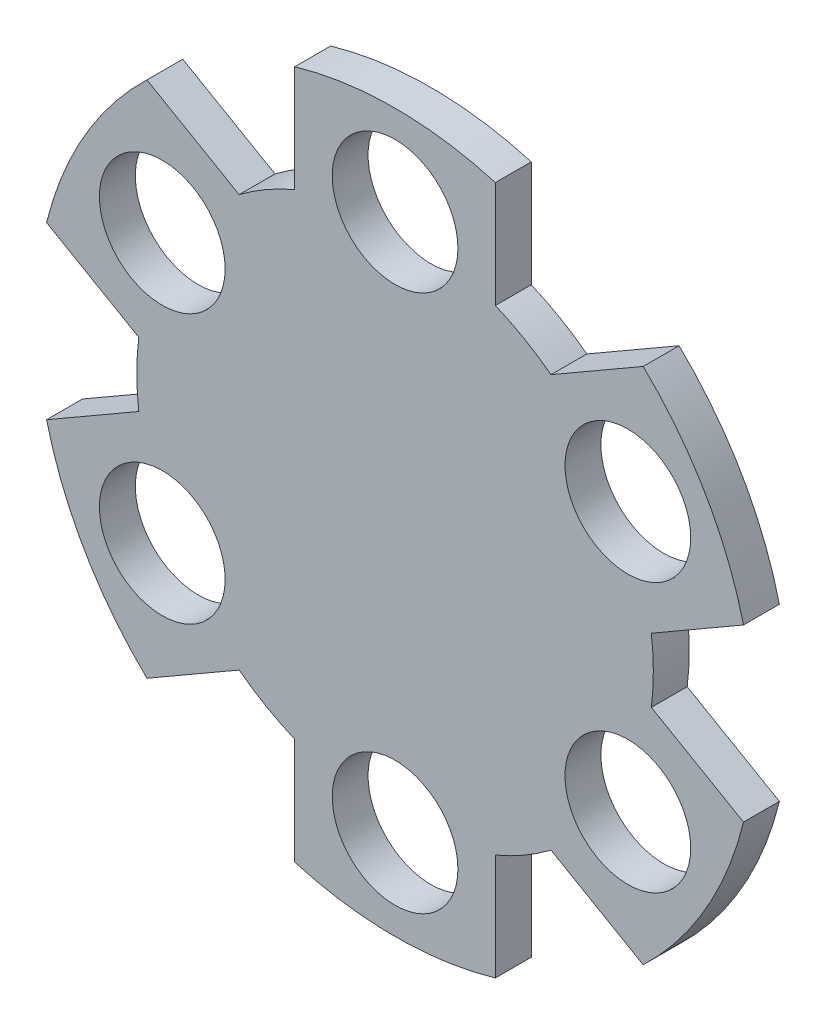
ISO-10303-21;
HEADER;
FILE_DESCRIPTION(('STEP AP214'),'2;1');
FILE_NAME('part.step','',(''),(''),'','','');
FILE_SCHEMA(('AUTOMOTIVE_DESIGN { 1 0 10303 214 1 1 1 1 }'));
ENDSEC;
DATA;
#1=APPLICATION_CONTEXT('core data for automotive mechanical design processes');
#2=APPLICATION_PROTOCOL_DEFINITION('international standard','automotive_design',2000,#1);
#3=PRODUCT_CONTEXT('',#1,'mechanical');
#4=PRODUCT('Part','Part','',(#3));
#5=PRODUCT_RELATED_PRODUCT_CATEGORY('part','',(#4));
#6=PRODUCT_DEFINITION_FORMATION('','',#4);
#7=PRODUCT_DEFINITION_CONTEXT('part definition',#1,'design');
#8=PRODUCT_DEFINITION('design','',#6,#7);
#9=PRODUCT_DEFINITION_SHAPE('','',#8);
#10=(LENGTH_UNIT() NAMED_UNIT(*) SI_UNIT(.MILLI.,.METRE.));
#11=(NAMED_UNIT(*) PLANE_ANGLE_UNIT() SI_UNIT($,.RADIAN.));
#12=(NAMED_UNIT(*) SI_UNIT($,.STERADIAN.) SOLID_ANGLE_UNIT());
#13=UNCERTAINTY_MEASURE_WITH_UNIT(LENGTH_MEASURE(1.E-05),#10,'distance_accuracy_value','');
#14=(GEOMETRIC_REPRESENTATION_CONTEXT(3) GLOBAL_UNCERTAINTY_ASSIGNED_CONTEXT((#13)) GLOBAL_UNIT_ASSIGNED_CONTEXT((#10,
#11,#12)) REPRESENTATION_CONTEXT('',''));
#15=CARTESIAN_POINT('',(0.,0.,0.));
#16=DIRECTION('',(0.,0.,1.));
#17=DIRECTION('',(1.,0.,0.));
#18=AXIS2_PLACEMENT_3D('',#15,#16,#17);
#19=CARTESIAN_POINT('',(0.,0.,3.175));
#20=DIRECTION('',(0.,0.,-1.));
#21=DIRECTION('',(-1.,0.,0.));
#22=AXIS2_PLACEMENT_3D('',#19,#20,#21);
#23=CYLINDRICAL_SURFACE('',#22,31.75);
#24=CARTESIAN_POINT('',(0.,0.,0.));
#25=DIRECTION('',(0.,0.,1.));
#26=DIRECTION('',(1.,0.,0.));
#27=AXIS2_PLACEMENT_3D('',#24,#25,#26);
#28=CIRCLE('',#27,31.75);
#29=CARTESIAN_POINT('',(30.8386744389797,7.5523942459741,0.));
#30=VERTEX_POINT('',#29);
#31=CARTESIAN_POINT('',(21.9599024959468,22.9308783601874,0.));
#32=VERTEX_POINT('',#31);
#33=EDGE_CURVE('E422',#30,#32,#28,.T.);
#34=ORIENTED_EDGE('',*,*,#33,.T.);
#35=DIRECTION('',(0.,0.,-1.));
#36=VECTOR('',#35,1.);
#37=CARTESIAN_POINT('',(21.9599024959468,22.9308783601874,3.175));
#38=LINE('',#37,#36);
#39=CARTESIAN_POINT('',(21.9599024959468,22.9308783601874,3.175));
#40=VERTEX_POINT('',#39);
#41=EDGE_CURVE('E224',#40,#32,#38,.T.);
#42=ORIENTED_EDGE('',*,*,#41,.F.);
#43=CARTESIAN_POINT('',(0.,0.,3.175));
#44=DIRECTION('',(0.,0.,1.));
#45=DIRECTION('',(1.,0.,0.));
#46=AXIS2_PLACEMENT_3D('',#43,#44,#45);
#47=CIRCLE('',#46,31.75);
#48=CARTESIAN_POINT('',(30.8386744390011,7.55239424598647,3.175));
#49=VERTEX_POINT('',#48);
#50=EDGE_CURVE('E435',#49,#40,#47,.T.);
#51=ORIENTED_EDGE('',*,*,#50,.F.);
#52=DIRECTION('',(0.,0.,-1.));
#53=VECTOR('',#52,1.);
#54=CARTESIAN_POINT('',(30.8386744390011,7.55239424598647,3.175));
#55=LINE('',#54,#53);
#56=EDGE_CURVE('E248',#49,#30,#55,.T.);
#57=ORIENTED_EDGE('',*,*,#56,.T.);
#58=EDGE_LOOP('',(#34,#42,#51,#57));
#59=FACE_BOUND('',#58,.T.);
#60=ADVANCED_FACE('F30',(#59),#23,.T.);
#61=CARTESIAN_POINT('',(21.9599024959057,-22.9308783602005,0.));
#62=VERTEX_POINT('',#61);
#63=CARTESIAN_POINT('',(30.8386744390274,-7.55239424603851,0.));
#64=VERTEX_POINT('',#63);
#65=EDGE_CURVE('E425',#62,#64,#28,.T.);
#66=ORIENTED_EDGE('',*,*,#65,.T.);
#67=DIRECTION('',(0.,0.,-1.));
#68=VECTOR('',#67,1.);
#69=CARTESIAN_POINT('',(30.8386744390274,-7.55239424603851,3.175));
#70=LINE('',#69,#68);
#71=CARTESIAN_POINT('',(30.8386744390274,-7.55239424603851,3.175));
#72=VERTEX_POINT('',#71);
#73=EDGE_CURVE('E246',#72,#64,#70,.T.);
#74=ORIENTED_EDGE('',*,*,#73,.F.);
#75=CARTESIAN_POINT('',(21.9599024959611,-22.9308783602325,3.175));
#76=VERTEX_POINT('',#75);
#77=EDGE_CURVE('E457',#76,#72,#47,.T.);
#78=ORIENTED_EDGE('',*,*,#77,.F.);
#79=DIRECTION('',(0.,0.,-1.));
#80=VECTOR('',#79,1.);
#81=CARTESIAN_POINT('',(21.9599024959611,-22.9308783602325,3.175));
#82=LINE('',#81,#80);
#83=EDGE_CURVE('E273',#76,#62,#82,.T.);
#84=ORIENTED_EDGE('',*,*,#83,.T.);
#85=EDGE_LOOP('',(#66,#74,#78,#84));
#86=FACE_BOUND('',#85,.T.);
#87=ADVANCED_FACE('F412',(#86),#23,.T.);
#88=CARTESIAN_POINT('',(-8.87877194303077,-30.4832726061958,0.));
#89=VERTEX_POINT('',#88);
#90=CARTESIAN_POINT('',(8.87877194308978,-30.4832726062678,0.));
#91=VERTEX_POINT('',#90);
#92=EDGE_CURVE('E427',#89,#91,#28,.T.);
#93=ORIENTED_EDGE('',*,*,#92,.T.);
#94=DIRECTION('',(0.,0.,-1.));
#95=VECTOR('',#94,1.);
#96=CARTESIAN_POINT('',(8.87877194308978,-30.4832726062678,3.175));
#97=LINE('',#96,#95);
#98=CARTESIAN_POINT('',(8.87877194308978,-30.4832726062678,3.175));
#99=VERTEX_POINT('',#98);
#100=EDGE_CURVE('E271',#99,#91,#97,.T.);
#101=ORIENTED_EDGE('',*,*,#100,.F.);
#102=CARTESIAN_POINT('',(-8.87877194303078,-30.4832726062609,3.175));
#103=VERTEX_POINT('',#102);
#104=EDGE_CURVE('E455',#103,#99,#47,.T.);
#105=ORIENTED_EDGE('',*,*,#104,.F.);
#106=DIRECTION('',(0.,0.,-1.));
#107=VECTOR('',#106,1.);
#108=CARTESIAN_POINT('',(-8.87877194303078,-30.4832726062609,3.175));
#109=LINE('',#108,#107);
#110=EDGE_CURVE('E299',#103,#89,#109,.T.);
#111=ORIENTED_EDGE('',*,*,#110,.T.);
#112=EDGE_LOOP('',(#93,#101,#105,#111));
#113=FACE_BOUND('',#112,.T.);
#114=ADVANCED_FACE('F417',(#113),#23,.T.);
#115=CARTESIAN_POINT('',(-30.8386744389594,-7.55239424605679,0.));
#116=VERTEX_POINT('',#115);
#117=CARTESIAN_POINT('',(-21.9599024959284,-22.9308783602711,0.));
#118=VERTEX_POINT('',#117);
#119=EDGE_CURVE('E431',#116,#118,#28,.T.);
#120=ORIENTED_EDGE('',*,*,#119,.T.);
#121=DIRECTION('',(0.,0.,-1.));
#122=VECTOR('',#121,1.);
#123=CARTESIAN_POINT('',(-21.9599024959284,-22.9308783602711,3.175));
#124=LINE('',#123,#122);
#125=CARTESIAN_POINT('',(-21.9599024959284,-22.9308783602711,3.175));
#126=VERTEX_POINT('',#125);
#127=EDGE_CURVE('E297',#126,#118,#124,.T.);
#128=ORIENTED_EDGE('',*,*,#127,.F.);
#129=CARTESIAN_POINT('',(-30.8386744389827,-7.55239424607023,3.175));
#130=VERTEX_POINT('',#129);
#131=EDGE_CURVE('E39',#130,#126,#47,.T.);
#132=ORIENTED_EDGE('',*,*,#131,.F.);
#133=DIRECTION('',(0.,0.,-1.));
#134=VECTOR('',#133,1.);
#135=CARTESIAN_POINT('',(-30.8386744389827,-7.55239424607023,3.175));
#136=LINE('',#135,#134);
#137=EDGE_CURVE('E325',#130,#116,#136,.T.);
#138=ORIENTED_EDGE('',*,*,#137,.T.);
#139=EDGE_LOOP('',(#120,#128,#132,#138));
#140=FACE_BOUND('',#139,.T.);
#141=ADVANCED_FACE('F550',(#140),#23,.T.);
#142=CARTESIAN_POINT('',(-21.9599024959534,22.9308783601549,0.));
#143=VERTEX_POINT('',#142);
#144=CARTESIAN_POINT('',(-30.838674439009,7.55239424595475,0.));
#145=VERTEX_POINT('',#144);
#146=EDGE_CURVE('E34',#143,#145,#28,.T.);
#147=ORIENTED_EDGE('',*,*,#146,.T.);
#148=DIRECTION('',(0.,0.,-1.));
#149=VECTOR('',#148,1.);
#150=CARTESIAN_POINT('',(-30.838674439009,7.55239424595475,3.175));
#151=LINE('',#150,#149);
#152=CARTESIAN_POINT('',(-30.838674439009,7.55239424595475,3.175));
#153=VERTEX_POINT('',#152);
#154=EDGE_CURVE('E323',#153,#145,#151,.T.);
#155=ORIENTED_EDGE('',*,*,#154,.F.);
#156=CARTESIAN_POINT('',(-21.9599024959428,22.9308783601487,3.175));
#157=VERTEX_POINT('',#156);
#158=EDGE_CURVE('E11',#157,#153,#47,.T.);
#159=ORIENTED_EDGE('',*,*,#158,.F.);
#160=DIRECTION('',(0.,0.,-1.));
#161=VECTOR('',#160,1.);
#162=CARTESIAN_POINT('',(-21.9599024959428,22.9308783601487,3.175));
#163=LINE('',#162,#161);
#164=EDGE_CURVE('E352',#157,#143,#163,.T.);
#165=ORIENTED_EDGE('',*,*,#164,.T.);
#166=EDGE_LOOP('',(#147,#155,#159,#165));
#167=FACE_BOUND('',#166,.T.);
#168=ADVANCED_FACE('F409',(#167),#23,.T.);
#169=CARTESIAN_POINT('',(0.,0.,3.175));
#170=DIRECTION('',(0.,0.,1.));
#171=DIRECTION('',(1.,0.,0.));
#172=AXIS2_PLACEMENT_3D('',#169,#170,#171);
#173=PLANE('',#172);
#174=DIRECTION('',(-0.866025403784438,-0.500000000000001,0.));
#175=VECTOR('',#174,1.);
#176=CARTESIAN_POINT('',(13.8006085226078,18.2201077882828,3.175));
#177=LINE('',#176,#175);
#178=CARTESIAN_POINT('',(13.8006085226078,18.2201077882828,3.175));
#179=VERTEX_POINT('',#178);
#180=EDGE_CURVE('E202',#40,#179,#177,.T.);
#181=ORIENTED_EDGE('',*,*,#180,.T.);
#182=CARTESIAN_POINT('',(1.45954906846256E-12,-4.35868577823845E-11,3.175));
#183=DIRECTION('',(0.,0.,1.));
#184=DIRECTION('',(1.,0.,0.));
#185=AXIS2_PLACEMENT_3D('',#182,#183,#184);
#186=CIRCLE('',#185,22.8567084990921);
#187=CARTESIAN_POINT('',(8.87877194304915,21.0617314623936,3.175));
#188=VERTEX_POINT('',#187);
#189=EDGE_CURVE('E197',#179,#188,#186,.T.);
#190=ORIENTED_EDGE('',*,*,#189,.T.);
#191=DIRECTION('',(0.,1.,0.));
#192=VECTOR('',#191,1.);
#193=CARTESIAN_POINT('',(8.87877194304915,30.4832726061771,3.175));
#194=LINE('',#193,#192);
#195=CARTESIAN_POINT('',(8.87877194304914,30.4832726061771,3.175));
#196=VERTEX_POINT('',#195);
#197=EDGE_CURVE('E205',#188,#196,#194,.T.);
#198=ORIENTED_EDGE('',*,*,#197,.T.);
#199=CARTESIAN_POINT('',(-8.8787719430714,30.483272606184,3.175));
#200=VERTEX_POINT('',#199);
#201=EDGE_CURVE('E40',#196,#200,#47,.T.);
#202=ORIENTED_EDGE('',*,*,#201,.T.);
#203=DIRECTION('',(0.,-1.,0.));
#204=VECTOR('',#203,1.);
#205=CARTESIAN_POINT('',(-8.87877194307139,21.0617314623749,3.175));
#206=LINE('',#205,#204);
#207=CARTESIAN_POINT('',(-8.87877194307139,21.0617314623749,3.175));
#208=VERTEX_POINT('',#207);
#209=EDGE_CURVE('E336',#200,#208,#206,.T.);
#210=ORIENTED_EDGE('',*,*,#209,.T.);
#211=CARTESIAN_POINT('',(1.69316229452944E-11,-4.01642589743796E-11,3.175));
#212=DIRECTION('',(0.,0.,1.));
#213=DIRECTION('',(1.,0.,0.));
#214=AXIS2_PLACEMENT_3D('',#211,#212,#213);
#215=CIRCLE('',#214,22.8567084990891);
#216=CARTESIAN_POINT('',(-13.8006085226259,18.220107788257,3.175));
#217=VERTEX_POINT('',#216);
#218=EDGE_CURVE('E329',#208,#217,#215,.T.);
#219=ORIENTED_EDGE('',*,*,#218,.T.);
#220=DIRECTION('',(-0.866025403784439,0.5,0.));
#221=VECTOR('',#220,1.);
#222=CARTESIAN_POINT('',(-13.8006085226259,18.220107788257,3.175));
#223=LINE('',#222,#221);
#224=EDGE_CURVE('E332',#217,#157,#223,.T.);
#225=ORIENTED_EDGE('',*,*,#224,.T.);
#226=ORIENTED_EDGE('',*,*,#158,.T.);
#227=DIRECTION('',(0.866025403784439,-0.499999999999999,0.));
#228=VECTOR('',#227,1.);
#229=CARTESIAN_POINT('',(-22.67938046567,2.84162367405021,3.175));
#230=LINE('',#229,#228);
#231=CARTESIAN_POINT('',(-22.67938046567,2.84162367405021,3.175));
#232=VERTEX_POINT('',#231);
#233=EDGE_CURVE('E310',#153,#232,#230,.T.);
#234=ORIENTED_EDGE('',*,*,#233,.T.);
#235=CARTESIAN_POINT('',(1.15815757187391E-11,-3.43203041630979E-11,3.175));
#236=DIRECTION('',(0.,0.,1.));
#237=DIRECTION('',(1.,0.,0.));
#238=AXIS2_PLACEMENT_3D('',#235,#236,#237);
#239=CIRCLE('',#238,22.8567084990891);
#240=CARTESIAN_POINT('',(-22.6793804656659,-2.84162367417849,3.175));
#241=VERTEX_POINT('',#240);
#242=EDGE_CURVE('E303',#232,#241,#239,.T.);
#243=ORIENTED_EDGE('',*,*,#242,.T.);
#244=DIRECTION('',(-0.866025403784439,-0.5,0.));
#245=VECTOR('',#244,1.);
#246=CARTESIAN_POINT('',(-22.6793804656659,-2.84162367417849,3.175));
#247=LINE('',#246,#245);
#248=EDGE_CURVE('E306',#241,#130,#247,.T.);
#249=ORIENTED_EDGE('',*,*,#248,.T.);
#250=ORIENTED_EDGE('',*,*,#131,.T.);
#251=DIRECTION('',(0.866025403784438,0.500000000000001,0.));
#252=VECTOR('',#251,1.);
#253=CARTESIAN_POINT('',(-13.8006085225894,-18.2201077883666,3.175));
#254=LINE('',#253,#252);
#255=CARTESIAN_POINT('',(-13.8006085225894,-18.2201077883666,3.175));
#256=VERTEX_POINT('',#255);
#257=EDGE_CURVE('E284',#126,#256,#254,.T.);
#258=ORIENTED_EDGE('',*,*,#257,.T.);
#259=CARTESIAN_POINT('',(3.84553878032322E-12,-3.60316035671003E-11,3.175));
#260=DIRECTION('',(0.,0.,1.));
#261=DIRECTION('',(1.,0.,0.));
#262=AXIS2_PLACEMENT_3D('',#259,#260,#261);
#263=CIRCLE('',#262,22.8567084990891);
#264=CARTESIAN_POINT('',(-8.87877194303077,-21.0617314624774,3.175));
#265=VERTEX_POINT('',#264);
#266=EDGE_CURVE('E277',#256,#265,#263,.T.);
#267=ORIENTED_EDGE('',*,*,#266,.T.);
#268=DIRECTION('',(0.,-1.,0.));
#269=VECTOR('',#268,1.);
#270=CARTESIAN_POINT('',(-8.87877194303077,-21.0617314624774,3.175));
#271=LINE('',#270,#269);
#272=EDGE_CURVE('E280',#265,#103,#271,.T.);
#273=ORIENTED_EDGE('',*,*,#272,.T.);
#274=ORIENTED_EDGE('',*,*,#104,.T.);
#275=DIRECTION('',(0.,1.,0.));
#276=VECTOR('',#275,1.);
#277=CARTESIAN_POINT('',(8.87877194308978,-21.0617314624587,3.175));
#278=LINE('',#277,#276);
#279=CARTESIAN_POINT('',(8.87877194308978,-21.0617314624587,3.175));
#280=VERTEX_POINT('',#279);
#281=EDGE_CURVE('E258',#99,#280,#278,.T.);
#282=ORIENTED_EDGE('',*,*,#281,.T.);
#283=CARTESIAN_POINT('',(1.45954906846256E-12,-4.35868577823845E-11,3.175));
#284=DIRECTION('',(0.,0.,1.));
#285=DIRECTION('',(1.,0.,0.));
#286=AXIS2_PLACEMENT_3D('',#283,#284,#285);
#287=CIRCLE('',#286,22.8567084990891);
#288=CARTESIAN_POINT('',(13.8006085226443,-18.2201077883407,3.175));
#289=VERTEX_POINT('',#288);
#290=EDGE_CURVE('E251',#280,#289,#287,.T.);
#291=ORIENTED_EDGE('',*,*,#290,.T.);
#292=DIRECTION('',(0.866025403784438,-0.5,0.));
#293=VECTOR('',#292,1.);
#294=CARTESIAN_POINT('',(13.8006085226443,-18.2201077883407,3.175));
#295=LINE('',#294,#293);
#296=EDGE_CURVE('E254',#289,#76,#295,.T.);
#297=ORIENTED_EDGE('',*,*,#296,.T.);
#298=ORIENTED_EDGE('',*,*,#77,.T.);
#299=DIRECTION('',(-0.866025403784439,0.5,0.));
#300=VECTOR('',#299,1.);
#301=CARTESIAN_POINT('',(22.6793804656884,-2.84162367413396,3.175));
#302=LINE('',#301,#300);
#303=CARTESIAN_POINT('',(22.6793804656884,-2.84162367413396,3.175));
#304=VERTEX_POINT('',#303);
#305=EDGE_CURVE('E234',#72,#304,#302,.T.);
#306=ORIENTED_EDGE('',*,*,#305,.T.);
#307=CARTESIAN_POINT('',(6.80959629501781E-12,-4.94308125936663E-11,3.175));
#308=DIRECTION('',(0.,0.,1.));
#309=DIRECTION('',(1.,0.,0.));
#310=AXIS2_PLACEMENT_3D('',#307,#308,#309);
#311=CIRCLE('',#310,22.8567084990891);
#312=CARTESIAN_POINT('',(22.6793804656843,2.84162367409473,3.175));
#313=VERTEX_POINT('',#312);
#314=EDGE_CURVE('E227',#304,#313,#311,.T.);
#315=ORIENTED_EDGE('',*,*,#314,.T.);
#316=DIRECTION('',(0.866025403784439,0.5,0.));
#317=VECTOR('',#316,1.);
#318=CARTESIAN_POINT('',(22.6793804656843,2.84162367409473,3.175));
#319=LINE('',#318,#317);
#320=EDGE_CURVE('E230',#313,#49,#319,.T.);
#321=ORIENTED_EDGE('',*,*,#320,.T.);
#322=ORIENTED_EDGE('',*,*,#50,.T.);
#323=EDGE_LOOP('',(#181,#190,#198,#202,#210,#219,#225,#226,#234,#243,#249,#250,#258,#267,#273,
#274,#282,#291,#297,#298,#306,#315,#321,#322));
#324=FACE_BOUND('',#323,.T.);
#325=CARTESIAN_POINT('',(-20.6025178388072,-11.8948692202191,3.175));
#326=DIRECTION('',(0.,0.,1.));
#327=DIRECTION('',(1.,0.,0.));
#328=AXIS2_PLACEMENT_3D('',#325,#326,#327);
#329=CIRCLE('',#328,5.5626);
#330=CARTESIAN_POINT('',(-15.0399178388072,-11.8948692202191,3.175));
#331=VERTEX_POINT('',#330);
#332=EDGE_CURVE('E362',#331,#331,#329,.T.);
#333=ORIENTED_EDGE('',*,*,#332,.F.);
#334=EDGE_LOOP('',(#333));
#335=FACE_BOUND('',#334,.T.);
#336=CARTESIAN_POINT('',(20.602517838807,-11.8948692202194,3.175));
#337=DIRECTION('',(0.,0.,1.));
#338=DIRECTION('',(1.,0.,0.));
#339=AXIS2_PLACEMENT_3D('',#336,#337,#338);
#340=CIRCLE('',#339,5.5626);
#341=CARTESIAN_POINT('',(26.165117838807,-11.8948692202194,3.175));
#342=VERTEX_POINT('',#341);
#343=EDGE_CURVE('E374',#342,#342,#340,.T.);
#344=ORIENTED_EDGE('',*,*,#343,.F.);
#345=EDGE_LOOP('',(#344));
#346=FACE_BOUND('',#345,.T.);
#347=CARTESIAN_POINT('',(0.,23.7897384404387,3.175));
#348=DIRECTION('',(0.,0.,1.));
#349=DIRECTION('',(1.,0.,0.));
#350=AXIS2_PLACEMENT_3D('',#347,#348,#349);
#351=CIRCLE('',#350,5.5626);
#352=CARTESIAN_POINT('',(5.5626,23.7897384404387,3.175));
#353=VERTEX_POINT('',#352);
#354=EDGE_CURVE('E386',#353,#353,#351,.T.);
#355=ORIENTED_EDGE('',*,*,#354,.F.);
#356=EDGE_LOOP('',(#355));
#357=FACE_BOUND('',#356,.T.);
#358=CARTESIAN_POINT('',(20.6025178388071,11.8948692202193,3.175));
#359=DIRECTION('',(0.,0.,1.));
#360=DIRECTION('',(1.,0.,0.));
#361=AXIS2_PLACEMENT_3D('',#358,#359,#360);
#362=CIRCLE('',#361,5.5626);
#363=CARTESIAN_POINT('',(26.1651178388071,11.8948692202193,3.175));
#364=VERTEX_POINT('',#363);
#365=EDGE_CURVE('E380',#364,#364,#362,.T.);
#366=ORIENTED_EDGE('',*,*,#365,.F.);
#367=EDGE_LOOP('',(#366));
#368=FACE_BOUND('',#367,.T.);
#369=CARTESIAN_POINT('',(-1.66122951859872E-13,-23.7897384404387,3.175));
#370=DIRECTION('',(0.,0.,1.));
#371=DIRECTION('',(1.,0.,0.));
#372=AXIS2_PLACEMENT_3D('',#369,#370,#371);
#373=CIRCLE('',#372,5.5626);
#374=CARTESIAN_POINT('',(5.56259999999983,-23.7897384404387,3.175));
#375=VERTEX_POINT('',#374);
#376=EDGE_CURVE('E368',#375,#375,#373,.T.);
#377=ORIENTED_EDGE('',*,*,#376,.F.);
#378=EDGE_LOOP('',(#377));
#379=FACE_BOUND('',#378,.T.);
#380=CARTESIAN_POINT('',(-20.6025178388069,11.8948692202196,3.175));
#381=DIRECTION('',(0.,0.,1.));
#382=DIRECTION('',(1.,0.,0.));
#383=AXIS2_PLACEMENT_3D('',#380,#381,#382);
#384=CIRCLE('',#383,5.5626);
#385=CARTESIAN_POINT('',(-15.0399178388069,11.8948692202196,3.175));
#386=VERTEX_POINT('',#385);
#387=EDGE_CURVE('E356',#386,#386,#384,.T.);
#388=ORIENTED_EDGE('',*,*,#387,.F.);
#389=EDGE_LOOP('',(#388));
#390=FACE_BOUND('',#389,.T.);
#391=ADVANCED_FACE('F210',(#324,#335,#346,#357,#368,#379,#390),#173,.T.);
#392=CARTESIAN_POINT('',(0.,0.,0.));
#393=DIRECTION('',(0.,0.,1.));
#394=DIRECTION('',(1.,0.,0.));
#395=AXIS2_PLACEMENT_3D('',#392,#393,#394);
#396=PLANE('',#395);
#397=CARTESIAN_POINT('',(-20.6025178388072,-11.8948692202191,0.));
#398=DIRECTION('',(0.,0.,1.));
#399=DIRECTION('',(1.,0.,0.));
#400=AXIS2_PLACEMENT_3D('',#397,#398,#399);
#401=CIRCLE('',#400,5.5626);
#402=CARTESIAN_POINT('',(-15.0399178388072,-11.8948692202191,0.));
#403=VERTEX_POINT('',#402);
#404=EDGE_CURVE('E359',#403,#403,#401,.T.);
#405=ORIENTED_EDGE('',*,*,#404,.T.);
#406=EDGE_LOOP('',(#405));
#407=FACE_BOUND('',#406,.T.);
#408=CARTESIAN_POINT('',(20.602517838807,-11.8948692202194,0.));
#409=DIRECTION('',(0.,0.,1.));
#410=DIRECTION('',(1.,0.,0.));
#411=AXIS2_PLACEMENT_3D('',#408,#409,#410);
#412=CIRCLE('',#411,5.5626);
#413=CARTESIAN_POINT('',(26.165117838807,-11.8948692202194,0.));
#414=VERTEX_POINT('',#413);
#415=EDGE_CURVE('E371',#414,#414,#412,.T.);
#416=ORIENTED_EDGE('',*,*,#415,.T.);
#417=EDGE_LOOP('',(#416));
#418=FACE_BOUND('',#417,.T.);
#419=CARTESIAN_POINT('',(0.,23.7897384404387,0.));
#420=DIRECTION('',(0.,0.,1.));
#421=DIRECTION('',(1.,0.,0.));
#422=AXIS2_PLACEMENT_3D('',#419,#420,#421);
#423=CIRCLE('',#422,5.5626);
#424=CARTESIAN_POINT('',(5.5626,23.7897384404387,0.));
#425=VERTEX_POINT('',#424);
#426=EDGE_CURVE('E383',#425,#425,#423,.T.);
#427=ORIENTED_EDGE('',*,*,#426,.T.);
#428=EDGE_LOOP('',(#427));
#429=FACE_BOUND('',#428,.T.);
#430=CARTESIAN_POINT('',(1.45954906846256E-12,-4.35868577823845E-11,0.));
#431=DIRECTION('',(0.,0.,1.));
#432=DIRECTION('',(1.,0.,0.));
#433=AXIS2_PLACEMENT_3D('',#430,#431,#432);
#434=CIRCLE('',#433,22.8567084990921);
#435=CARTESIAN_POINT('',(13.8006085226078,18.2201077882828,0.));
#436=VERTEX_POINT('',#435);
#437=CARTESIAN_POINT('',(8.87877194304915,21.0617314623936,0.));
#438=VERTEX_POINT('',#437);
#439=EDGE_CURVE('E200',#436,#438,#434,.T.);
#440=ORIENTED_EDGE('',*,*,#439,.F.);
#441=DIRECTION('',(-0.866025403784438,-0.500000000000001,0.));
#442=VECTOR('',#441,1.);
#443=CARTESIAN_POINT('',(13.8006085226078,18.2201077882828,0.));
#444=LINE('',#443,#442);
#445=EDGE_CURVE('E213',#32,#436,#444,.T.);
#446=ORIENTED_EDGE('',*,*,#445,.F.);
#447=ORIENTED_EDGE('',*,*,#33,.F.);
#448=DIRECTION('',(0.866025403784439,0.5,0.));
#449=VECTOR('',#448,1.);
#450=CARTESIAN_POINT('',(22.6793804656843,2.84162367409473,0.));
#451=LINE('',#450,#449);
#452=CARTESIAN_POINT('',(22.6793804656843,2.84162367409473,0.));
#453=VERTEX_POINT('',#452);
#454=EDGE_CURVE('E55',#453,#30,#451,.T.);
#455=ORIENTED_EDGE('',*,*,#454,.F.);
#456=CARTESIAN_POINT('',(6.80959629501781E-12,-4.94308125936663E-11,0.));
#457=DIRECTION('',(0.,0.,1.));
#458=DIRECTION('',(1.,0.,0.));
#459=AXIS2_PLACEMENT_3D('',#456,#457,#458);
#460=CIRCLE('',#459,22.8567084990891);
#461=CARTESIAN_POINT('',(22.6793804656884,-2.84162367413396,0.));
#462=VERTEX_POINT('',#461);
#463=EDGE_CURVE('E223',#462,#453,#460,.T.);
#464=ORIENTED_EDGE('',*,*,#463,.F.);
#465=DIRECTION('',(-0.866025403784439,0.5,0.));
#466=VECTOR('',#465,1.);
#467=CARTESIAN_POINT('',(22.6793804656884,-2.84162367413396,0.));
#468=LINE('',#467,#466);
#469=EDGE_CURVE('E231',#64,#462,#468,.T.);
#470=ORIENTED_EDGE('',*,*,#469,.F.);
#471=ORIENTED_EDGE('',*,*,#65,.F.);
#472=DIRECTION('',(0.866025403784438,-0.5,0.));
#473=VECTOR('',#472,1.);
#474=CARTESIAN_POINT('',(13.8006085226443,-18.2201077883407,0.));
#475=LINE('',#474,#473);
#476=CARTESIAN_POINT('',(13.8006085226443,-18.2201077883407,0.));
#477=VERTEX_POINT('',#476);
#478=EDGE_CURVE('E264',#477,#62,#475,.T.);
#479=ORIENTED_EDGE('',*,*,#478,.F.);
#480=CARTESIAN_POINT('',(1.45954906846256E-12,-4.35868577823845E-11,0.));
#481=DIRECTION('',(0.,0.,1.));
#482=DIRECTION('',(1.,0.,0.));
#483=AXIS2_PLACEMENT_3D('',#480,#481,#482);
#484=CIRCLE('',#483,22.8567084990891);
#485=CARTESIAN_POINT('',(8.87877194308978,-21.0617314624587,0.));
#486=VERTEX_POINT('',#485);
#487=EDGE_CURVE('E245',#486,#477,#484,.T.);
#488=ORIENTED_EDGE('',*,*,#487,.F.);
#489=DIRECTION('',(0.,1.,0.));
#490=VECTOR('',#489,1.);
#491=CARTESIAN_POINT('',(8.87877194308978,-21.0617314624587,0.));
#492=LINE('',#491,#490);
#493=EDGE_CURVE('E255',#91,#486,#492,.T.);
#494=ORIENTED_EDGE('',*,*,#493,.F.);
#495=ORIENTED_EDGE('',*,*,#92,.F.);
#496=DIRECTION('',(0.,-1.,0.));
#497=VECTOR('',#496,1.);
#498=CARTESIAN_POINT('',(-8.87877194303077,-21.0617314624774,0.));
#499=LINE('',#498,#497);
#500=CARTESIAN_POINT('',(-8.87877194303077,-21.0617314624774,0.));
#501=VERTEX_POINT('',#500);
#502=EDGE_CURVE('E290',#501,#89,#499,.T.);
#503=ORIENTED_EDGE('',*,*,#502,.F.);
#504=CARTESIAN_POINT('',(3.84553878032322E-12,-3.60316035671003E-11,0.));
#505=DIRECTION('',(0.,0.,1.));
#506=DIRECTION('',(1.,0.,0.));
#507=AXIS2_PLACEMENT_3D('',#504,#505,#506);
#508=CIRCLE('',#507,22.8567084990891);
#509=CARTESIAN_POINT('',(-13.8006085225894,-18.2201077883666,0.));
#510=VERTEX_POINT('',#509);
#511=EDGE_CURVE('E270',#510,#501,#508,.T.);
#512=ORIENTED_EDGE('',*,*,#511,.F.);
#513=DIRECTION('',(0.866025403784438,0.500000000000001,0.));
#514=VECTOR('',#513,1.);
#515=CARTESIAN_POINT('',(-13.8006085225894,-18.2201077883666,0.));
#516=LINE('',#515,#514);
#517=EDGE_CURVE('E281',#118,#510,#516,.T.);
#518=ORIENTED_EDGE('',*,*,#517,.F.);
#519=ORIENTED_EDGE('',*,*,#119,.F.);
#520=DIRECTION('',(-0.866025403784439,-0.5,0.));
#521=VECTOR('',#520,1.);
#522=CARTESIAN_POINT('',(-22.6793804656659,-2.84162367417849,0.));
#523=LINE('',#522,#521);
#524=CARTESIAN_POINT('',(-22.6793804656659,-2.84162367417849,0.));
#525=VERTEX_POINT('',#524);
#526=EDGE_CURVE('E316',#525,#116,#523,.T.);
#527=ORIENTED_EDGE('',*,*,#526,.F.);
#528=CARTESIAN_POINT('',(1.15815757187391E-11,-3.43203041630979E-11,0.));
#529=DIRECTION('',(0.,0.,1.));
#530=DIRECTION('',(1.,0.,0.));
#531=AXIS2_PLACEMENT_3D('',#528,#529,#530);
#532=CIRCLE('',#531,22.8567084990891);
#533=CARTESIAN_POINT('',(-22.67938046567,2.84162367405021,0.));
#534=VERTEX_POINT('',#533);
#535=EDGE_CURVE('E296',#534,#525,#532,.T.);
#536=ORIENTED_EDGE('',*,*,#535,.F.);
#537=DIRECTION('',(0.866025403784439,-0.499999999999999,0.));
#538=VECTOR('',#537,1.);
#539=CARTESIAN_POINT('',(-22.67938046567,2.84162367405021,0.));
#540=LINE('',#539,#538);
#541=EDGE_CURVE('E307',#145,#534,#540,.T.);
#542=ORIENTED_EDGE('',*,*,#541,.F.);
#543=ORIENTED_EDGE('',*,*,#146,.F.);
#544=DIRECTION('',(-0.866025403784439,0.5,0.));
#545=VECTOR('',#544,1.);
#546=CARTESIAN_POINT('',(-13.8006085226259,18.220107788257,0.));
#547=LINE('',#546,#545);
#548=CARTESIAN_POINT('',(-13.8006085226259,18.220107788257,0.));
#549=VERTEX_POINT('',#548);
#550=EDGE_CURVE('E342',#549,#143,#547,.T.);
#551=ORIENTED_EDGE('',*,*,#550,.F.);
#552=CARTESIAN_POINT('',(1.69316229452944E-11,-4.01642589743796E-11,0.));
#553=DIRECTION('',(0.,0.,1.));
#554=DIRECTION('',(1.,0.,0.));
#555=AXIS2_PLACEMENT_3D('',#552,#553,#554);
#556=CIRCLE('',#555,22.8567084990891);
#557=CARTESIAN_POINT('',(-8.87877194307139,21.0617314623749,0.));
#558=VERTEX_POINT('',#557);
#559=EDGE_CURVE('E322',#558,#549,#556,.T.);
#560=ORIENTED_EDGE('',*,*,#559,.F.);
#561=DIRECTION('',(0.,-1.,0.));
#562=VECTOR('',#561,1.);
#563=CARTESIAN_POINT('',(-8.87877194307139,21.0617314623749,0.));
#564=LINE('',#563,#562);
#565=CARTESIAN_POINT('',(-8.8787719430714,30.483272606184,0.));
#566=VERTEX_POINT('',#565);
#567=EDGE_CURVE('E333',#566,#558,#564,.T.);
#568=ORIENTED_EDGE('',*,*,#567,.F.);
#569=CARTESIAN_POINT('',(8.87877194304915,30.4832726061905,0.));
#570=VERTEX_POINT('',#569);
#571=EDGE_CURVE('E389',#570,#566,#28,.T.);
#572=ORIENTED_EDGE('',*,*,#571,.F.);
#573=DIRECTION('',(0.,1.,0.));
#574=VECTOR('',#573,1.);
#575=CARTESIAN_POINT('',(8.87877194304915,30.4832726061771,0.));
#576=LINE('',#575,#574);
#577=EDGE_CURVE('E47',#438,#570,#576,.T.);
#578=ORIENTED_EDGE('',*,*,#577,.F.);
#579=EDGE_LOOP('',(#440,#446,#447,#455,#464,#470,#471,#479,#488,#494,#495,#503,#512,#518,#519,
#527,#536,#542,#543,#551,#560,#568,#572,#578));
#580=FACE_BOUND('',#579,.T.);
#581=CARTESIAN_POINT('',(20.6025178388071,11.8948692202193,0.));
#582=DIRECTION('',(0.,0.,1.));
#583=DIRECTION('',(1.,0.,0.));
#584=AXIS2_PLACEMENT_3D('',#581,#582,#583);
#585=CIRCLE('',#584,5.5626);
#586=CARTESIAN_POINT('',(26.1651178388071,11.8948692202193,0.));
#587=VERTEX_POINT('',#586);
#588=EDGE_CURVE('E377',#587,#587,#585,.T.);
#589=ORIENTED_EDGE('',*,*,#588,.T.);
#590=EDGE_LOOP('',(#589));
#591=FACE_BOUND('',#590,.T.);
#592=CARTESIAN_POINT('',(-1.66122951859872E-13,-23.7897384404387,0.));
#593=DIRECTION('',(0.,0.,1.));
#594=DIRECTION('',(1.,0.,0.));
#595=AXIS2_PLACEMENT_3D('',#592,#593,#594);
#596=CIRCLE('',#595,5.5626);
#597=CARTESIAN_POINT('',(5.56259999999983,-23.7897384404387,0.));
#598=VERTEX_POINT('',#597);
#599=EDGE_CURVE('E365',#598,#598,#596,.T.);
#600=ORIENTED_EDGE('',*,*,#599,.T.);
#601=EDGE_LOOP('',(#600));
#602=FACE_BOUND('',#601,.T.);
#603=CARTESIAN_POINT('',(-20.6025178388069,11.8948692202196,0.));
#604=DIRECTION('',(0.,0.,1.));
#605=DIRECTION('',(1.,0.,0.));
#606=AXIS2_PLACEMENT_3D('',#603,#604,#605);
#607=CIRCLE('',#606,5.5626);
#608=CARTESIAN_POINT('',(-15.0399178388069,11.8948692202196,0.));
#609=VERTEX_POINT('',#608);
#610=EDGE_CURVE('E348',#609,#609,#607,.T.);
#611=ORIENTED_EDGE('',*,*,#610,.T.);
#612=EDGE_LOOP('',(#611));
#613=FACE_BOUND('',#612,.T.);
#614=ADVANCED_FACE('F393',(#407,#418,#429,#580,#591,#602,#613),#396,.F.);
#615=ORIENTED_EDGE('',*,*,#201,.F.);
#616=DIRECTION('',(0.,0.,-1.));
#617=VECTOR('',#616,1.);
#618=CARTESIAN_POINT('',(8.87877194304914,30.4832726061771,3.175));
#619=LINE('',#618,#617);
#620=EDGE_CURVE('E201',#196,#570,#619,.T.);
#621=ORIENTED_EDGE('',*,*,#620,.T.);
#622=ORIENTED_EDGE('',*,*,#571,.T.);
#623=DIRECTION('',(0.,0.,-1.));
#624=VECTOR('',#623,1.);
#625=CARTESIAN_POINT('',(-8.8787719430714,30.483272606184,3.175));
#626=LINE('',#625,#624);
#627=EDGE_CURVE('E349',#200,#566,#626,.T.);
#628=ORIENTED_EDGE('',*,*,#627,.F.);
#629=EDGE_LOOP('',(#615,#621,#622,#628));
#630=FACE_BOUND('',#629,.T.);
#631=ADVANCED_FACE('F32',(#630),#23,.T.);
#632=CARTESIAN_POINT('',(0.,23.7897384404387,3.175));
#633=DIRECTION('',(0.,0.,-1.));
#634=DIRECTION('',(-1.,0.,0.));
#635=AXIS2_PLACEMENT_3D('',#632,#633,#634);
#636=CYLINDRICAL_SURFACE('',#635,5.5626);
#637=ORIENTED_EDGE('',*,*,#354,.T.);
#638=EDGE_LOOP('',(#637));
#639=FACE_BOUND('',#638,.T.);
#640=ORIENTED_EDGE('',*,*,#426,.F.);
#641=EDGE_LOOP('',(#640));
#642=FACE_BOUND('',#641,.T.);
#643=ADVANCED_FACE('F396',(#639,#642),#636,.F.);
#644=CARTESIAN_POINT('',(20.6025178388071,11.8948692202193,3.175));
#645=DIRECTION('',(0.,0.,-1.));
#646=DIRECTION('',(-1.,0.,0.));
#647=AXIS2_PLACEMENT_3D('',#644,#645,#646);
#648=CYLINDRICAL_SURFACE('',#647,5.5626);
#649=ORIENTED_EDGE('',*,*,#365,.T.);
#650=EDGE_LOOP('',(#649));
#651=FACE_BOUND('',#650,.T.);
#652=ORIENTED_EDGE('',*,*,#588,.F.);
#653=EDGE_LOOP('',(#652));
#654=FACE_BOUND('',#653,.T.);
#655=ADVANCED_FACE('F398',(#651,#654),#648,.F.);
#656=CARTESIAN_POINT('',(20.602517838807,-11.8948692202194,3.175));
#657=DIRECTION('',(0.,0.,-1.));
#658=DIRECTION('',(-1.,0.,0.));
#659=AXIS2_PLACEMENT_3D('',#656,#657,#658);
#660=CYLINDRICAL_SURFACE('',#659,5.5626);
#661=ORIENTED_EDGE('',*,*,#343,.T.);
#662=EDGE_LOOP('',(#661));
#663=FACE_BOUND('',#662,.T.);
#664=ORIENTED_EDGE('',*,*,#415,.F.);
#665=EDGE_LOOP('',(#664));
#666=FACE_BOUND('',#665,.T.);
#667=ADVANCED_FACE('F405',(#663,#666),#660,.F.);
#668=CARTESIAN_POINT('',(-1.66122951859872E-13,-23.7897384404387,3.175));
#669=DIRECTION('',(0.,0.,-1.));
#670=DIRECTION('',(-1.,0.,0.));
#671=AXIS2_PLACEMENT_3D('',#668,#669,#670);
#672=CYLINDRICAL_SURFACE('',#671,5.5626);
#673=ORIENTED_EDGE('',*,*,#376,.T.);
#674=EDGE_LOOP('',(#673));
#675=FACE_BOUND('',#674,.T.);
#676=ORIENTED_EDGE('',*,*,#599,.F.);
#677=EDGE_LOOP('',(#676));
#678=FACE_BOUND('',#677,.T.);
#679=ADVANCED_FACE('F527',(#675,#678),#672,.F.);
#680=CARTESIAN_POINT('',(-20.6025178388072,-11.8948692202191,3.175));
#681=DIRECTION('',(0.,0.,-1.));
#682=DIRECTION('',(-1.,0.,0.));
#683=AXIS2_PLACEMENT_3D('',#680,#681,#682);
#684=CYLINDRICAL_SURFACE('',#683,5.5626);
#685=ORIENTED_EDGE('',*,*,#332,.T.);
#686=EDGE_LOOP('',(#685));
#687=FACE_BOUND('',#686,.T.);
#688=ORIENTED_EDGE('',*,*,#404,.F.);
#689=EDGE_LOOP('',(#688));
#690=FACE_BOUND('',#689,.T.);
#691=ADVANCED_FACE('F523',(#687,#690),#684,.F.);
#692=CARTESIAN_POINT('',(-20.6025178388069,11.8948692202196,3.175));
#693=DIRECTION('',(0.,0.,-1.));
#694=DIRECTION('',(-1.,0.,0.));
#695=AXIS2_PLACEMENT_3D('',#692,#693,#694);
#696=CYLINDRICAL_SURFACE('',#695,5.5626);
#697=ORIENTED_EDGE('',*,*,#387,.T.);
#698=EDGE_LOOP('',(#697));
#699=FACE_BOUND('',#698,.T.);
#700=ORIENTED_EDGE('',*,*,#610,.F.);
#701=EDGE_LOOP('',(#700));
#702=FACE_BOUND('',#701,.T.);
#703=ADVANCED_FACE('F519',(#699,#702),#696,.F.);
#704=CARTESIAN_POINT('',(1.69316229452944E-11,-4.01642589743796E-11,3.175));
#705=DIRECTION('',(0.,0.,-1.));
#706=DIRECTION('',(-1.,0.,0.));
#707=AXIS2_PLACEMENT_3D('',#704,#705,#706);
#708=CYLINDRICAL_SURFACE('',#707,22.8567084990891);
#709=ORIENTED_EDGE('',*,*,#559,.T.);
#710=DIRECTION('',(0.,0.,-1.));
#711=VECTOR('',#710,1.);
#712=CARTESIAN_POINT('',(-13.8006085226259,18.220107788257,3.175));
#713=LINE('',#712,#711);
#714=EDGE_CURVE('E339',#217,#549,#713,.T.);
#715=ORIENTED_EDGE('',*,*,#714,.F.);
#716=ORIENTED_EDGE('',*,*,#218,.F.);
#717=DIRECTION('',(0.,0.,-1.));
#718=VECTOR('',#717,1.);
#719=CARTESIAN_POINT('',(-8.87877194307139,21.0617314623749,3.175));
#720=LINE('',#719,#718);
#721=EDGE_CURVE('E346',#208,#558,#720,.T.);
#722=ORIENTED_EDGE('',*,*,#721,.T.);
#723=EDGE_LOOP('',(#709,#715,#716,#722));
#724=FACE_BOUND('',#723,.T.);
#725=ADVANCED_FACE('F512',(#724),#708,.T.);
#726=CARTESIAN_POINT('',(-8.87877194307139,21.0617314623749,3.175));
#727=DIRECTION('',(1.,0.,0.));
#728=DIRECTION('',(0.,1.,0.));
#729=AXIS2_PLACEMENT_3D('',#726,#727,#728);
#730=PLANE('',#729);
#731=ORIENTED_EDGE('',*,*,#567,.T.);
#732=ORIENTED_EDGE('',*,*,#721,.F.);
#733=ORIENTED_EDGE('',*,*,#209,.F.);
#734=ORIENTED_EDGE('',*,*,#627,.T.);
#735=EDGE_LOOP('',(#731,#732,#733,#734));
#736=FACE_BOUND('',#735,.T.);
#737=ADVANCED_FACE('F509',(#736),#730,.F.);
#738=CARTESIAN_POINT('',(-13.8006085226259,18.220107788257,3.175));
#739=DIRECTION('',(-0.5,-0.866025403784439,0.));
#740=DIRECTION('',(0.866025403784439,-0.5,0.));
#741=AXIS2_PLACEMENT_3D('',#738,#739,#740);
#742=PLANE('',#741);
#743=ORIENTED_EDGE('',*,*,#550,.T.);
#744=ORIENTED_EDGE('',*,*,#164,.F.);
#745=ORIENTED_EDGE('',*,*,#224,.F.);
#746=ORIENTED_EDGE('',*,*,#714,.T.);
#747=EDGE_LOOP('',(#743,#744,#745,#746));
#748=FACE_BOUND('',#747,.T.);
#749=ADVANCED_FACE('F507',(#748),#742,.F.);
#750=CARTESIAN_POINT('',(1.15815757187391E-11,-3.43203041630979E-11,3.175));
#751=DIRECTION('',(0.,0.,-1.));
#752=DIRECTION('',(-1.,0.,0.));
#753=AXIS2_PLACEMENT_3D('',#750,#751,#752);
#754=CYLINDRICAL_SURFACE('',#753,22.8567084990891);
#755=ORIENTED_EDGE('',*,*,#535,.T.);
#756=DIRECTION('',(0.,0.,-1.));
#757=VECTOR('',#756,1.);
#758=CARTESIAN_POINT('',(-22.6793804656659,-2.84162367417849,3.175));
#759=LINE('',#758,#757);
#760=EDGE_CURVE('E313',#241,#525,#759,.T.);
#761=ORIENTED_EDGE('',*,*,#760,.F.);
#762=ORIENTED_EDGE('',*,*,#242,.F.);
#763=DIRECTION('',(0.,0.,-1.));
#764=VECTOR('',#763,1.);
#765=CARTESIAN_POINT('',(-22.67938046567,2.84162367405021,3.175));
#766=LINE('',#765,#764);
#767=EDGE_CURVE('E320',#232,#534,#766,.T.);
#768=ORIENTED_EDGE('',*,*,#767,.T.);
#769=EDGE_LOOP('',(#755,#761,#762,#768));
#770=FACE_BOUND('',#769,.T.);
#771=ADVANCED_FACE('F500',(#770),#754,.T.);
#772=CARTESIAN_POINT('',(-22.67938046567,2.84162367405021,3.175));
#773=DIRECTION('',(0.499999999999999,0.866025403784439,0.));
#774=DIRECTION('',(-0.866025403784439,0.499999999999999,0.));
#775=AXIS2_PLACEMENT_3D('',#772,#773,#774);
#776=PLANE('',#775);
#777=ORIENTED_EDGE('',*,*,#541,.T.);
#778=ORIENTED_EDGE('',*,*,#767,.F.);
#779=ORIENTED_EDGE('',*,*,#233,.F.);
#780=ORIENTED_EDGE('',*,*,#154,.T.);
#781=EDGE_LOOP('',(#777,#778,#779,#780));
#782=FACE_BOUND('',#781,.T.);
#783=ADVANCED_FACE('F497',(#782),#776,.F.);
#784=CARTESIAN_POINT('',(-22.6793804656659,-2.84162367417849,3.175));
#785=DIRECTION('',(0.5,-0.866025403784439,0.));
#786=DIRECTION('',(0.866025403784439,0.5,0.));
#787=AXIS2_PLACEMENT_3D('',#784,#785,#786);
#788=PLANE('',#787);
#789=ORIENTED_EDGE('',*,*,#526,.T.);
#790=ORIENTED_EDGE('',*,*,#137,.F.);
#791=ORIENTED_EDGE('',*,*,#248,.F.);
#792=ORIENTED_EDGE('',*,*,#760,.T.);
#793=EDGE_LOOP('',(#789,#790,#791,#792));
#794=FACE_BOUND('',#793,.T.);
#795=ADVANCED_FACE('F495',(#794),#788,.F.);
#796=CARTESIAN_POINT('',(3.84553878032322E-12,-3.60316035671003E-11,3.175));
#797=DIRECTION('',(0.,0.,-1.));
#798=DIRECTION('',(-1.,0.,0.));
#799=AXIS2_PLACEMENT_3D('',#796,#797,#798);
#800=CYLINDRICAL_SURFACE('',#799,22.8567084990891);
#801=ORIENTED_EDGE('',*,*,#511,.T.);
#802=DIRECTION('',(0.,0.,-1.));
#803=VECTOR('',#802,1.);
#804=CARTESIAN_POINT('',(-8.87877194303077,-21.0617314624774,3.175));
#805=LINE('',#804,#803);
#806=EDGE_CURVE('E287',#265,#501,#805,.T.);
#807=ORIENTED_EDGE('',*,*,#806,.F.);
#808=ORIENTED_EDGE('',*,*,#266,.F.);
#809=DIRECTION('',(0.,0.,-1.));
#810=VECTOR('',#809,1.);
#811=CARTESIAN_POINT('',(-13.8006085225894,-18.2201077883666,3.175));
#812=LINE('',#811,#810);
#813=EDGE_CURVE('E294',#256,#510,#812,.T.);
#814=ORIENTED_EDGE('',*,*,#813,.T.);
#815=EDGE_LOOP('',(#801,#807,#808,#814));
#816=FACE_BOUND('',#815,.T.);
#817=ADVANCED_FACE('F490',(#816),#800,.T.);
#818=CARTESIAN_POINT('',(-13.8006085225894,-18.2201077883666,3.175));
#819=DIRECTION('',(-0.500000000000001,0.866025403784438,0.));
#820=DIRECTION('',(-0.866025403784438,-0.500000000000001,0.));
#821=AXIS2_PLACEMENT_3D('',#818,#819,#820);
#822=PLANE('',#821);
#823=ORIENTED_EDGE('',*,*,#517,.T.);
#824=ORIENTED_EDGE('',*,*,#813,.F.);
#825=ORIENTED_EDGE('',*,*,#257,.F.);
#826=ORIENTED_EDGE('',*,*,#127,.T.);
#827=EDGE_LOOP('',(#823,#824,#825,#826));
#828=FACE_BOUND('',#827,.T.);
#829=ADVANCED_FACE('F484',(#828),#822,.F.);
#830=CARTESIAN_POINT('',(-8.87877194303077,-21.0617314624774,3.175));
#831=DIRECTION('',(1.,0.,0.));
#832=DIRECTION('',(0.,1.,0.));
#833=AXIS2_PLACEMENT_3D('',#830,#831,#832);
#834=PLANE('',#833);
#835=ORIENTED_EDGE('',*,*,#502,.T.);
#836=ORIENTED_EDGE('',*,*,#110,.F.);
#837=ORIENTED_EDGE('',*,*,#272,.F.);
#838=ORIENTED_EDGE('',*,*,#806,.T.);
#839=EDGE_LOOP('',(#835,#836,#837,#838));
#840=FACE_BOUND('',#839,.T.);
#841=ADVANCED_FACE('F477',(#840),#834,.F.);
#842=CARTESIAN_POINT('',(1.45954906846256E-12,-4.35868577823845E-11,3.175));
#843=DIRECTION('',(0.,0.,-1.));
#844=DIRECTION('',(-1.,0.,0.));
#845=AXIS2_PLACEMENT_3D('',#842,#843,#844);
#846=CYLINDRICAL_SURFACE('',#845,22.8567084990891);
#847=ORIENTED_EDGE('',*,*,#487,.T.);
#848=DIRECTION('',(0.,0.,-1.));
#849=VECTOR('',#848,1.);
#850=CARTESIAN_POINT('',(13.8006085226443,-18.2201077883407,3.175));
#851=LINE('',#850,#849);
#852=EDGE_CURVE('E261',#289,#477,#851,.T.);
#853=ORIENTED_EDGE('',*,*,#852,.F.);
#854=ORIENTED_EDGE('',*,*,#290,.F.);
#855=DIRECTION('',(0.,0.,-1.));
#856=VECTOR('',#855,1.);
#857=CARTESIAN_POINT('',(8.87877194308978,-21.0617314624587,3.175));
#858=LINE('',#857,#856);
#859=EDGE_CURVE('E268',#280,#486,#858,.T.);
#860=ORIENTED_EDGE('',*,*,#859,.T.);
#861=EDGE_LOOP('',(#847,#853,#854,#860));
#862=FACE_BOUND('',#861,.T.);
#863=ADVANCED_FACE('F475',(#862),#846,.T.);
#864=CARTESIAN_POINT('',(8.87877194308978,-21.0617314624587,3.175));
#865=DIRECTION('',(-1.,0.,0.));
#866=DIRECTION('',(0.,-1.,0.));
#867=AXIS2_PLACEMENT_3D('',#864,#865,#866);
#868=PLANE('',#867);
#869=ORIENTED_EDGE('',*,*,#493,.T.);
#870=ORIENTED_EDGE('',*,*,#859,.F.);
#871=ORIENTED_EDGE('',*,*,#281,.F.);
#872=ORIENTED_EDGE('',*,*,#100,.T.);
#873=EDGE_LOOP('',(#869,#870,#871,#872));
#874=FACE_BOUND('',#873,.T.);
#875=ADVANCED_FACE('F453',(#874),#868,.F.);
#876=CARTESIAN_POINT('',(13.8006085226443,-18.2201077883407,3.175));
#877=DIRECTION('',(0.5,0.866025403784438,0.));
#878=DIRECTION('',(-0.866025403784438,0.5,0.));
#879=AXIS2_PLACEMENT_3D('',#876,#877,#878);
#880=PLANE('',#879);
#881=ORIENTED_EDGE('',*,*,#478,.T.);
#882=ORIENTED_EDGE('',*,*,#83,.F.);
#883=ORIENTED_EDGE('',*,*,#296,.F.);
#884=ORIENTED_EDGE('',*,*,#852,.T.);
#885=EDGE_LOOP('',(#881,#882,#883,#884));
#886=FACE_BOUND('',#885,.T.);
#887=ADVANCED_FACE('F473',(#886),#880,.F.);
#888=CARTESIAN_POINT('',(6.80959629501781E-12,-4.94308125936663E-11,3.175));
#889=DIRECTION('',(0.,0.,-1.));
#890=DIRECTION('',(-1.,0.,0.));
#891=AXIS2_PLACEMENT_3D('',#888,#889,#890);
#892=CYLINDRICAL_SURFACE('',#891,22.8567084990891);
#893=ORIENTED_EDGE('',*,*,#463,.T.);
#894=DIRECTION('',(0.,0.,-1.));
#895=VECTOR('',#894,1.);
#896=CARTESIAN_POINT('',(22.6793804656843,2.84162367409473,3.175));
#897=LINE('',#896,#895);
#898=EDGE_CURVE('E237',#313,#453,#897,.T.);
#899=ORIENTED_EDGE('',*,*,#898,.F.);
#900=ORIENTED_EDGE('',*,*,#314,.F.);
#901=DIRECTION('',(0.,0.,-1.));
#902=VECTOR('',#901,1.);
#903=CARTESIAN_POINT('',(22.6793804656884,-2.84162367413396,3.175));
#904=LINE('',#903,#902);
#905=EDGE_CURVE('E243',#304,#462,#904,.T.);
#906=ORIENTED_EDGE('',*,*,#905,.T.);
#907=EDGE_LOOP('',(#893,#899,#900,#906));
#908=FACE_BOUND('',#907,.T.);
#909=ADVANCED_FACE('F466',(#908),#892,.T.);
#910=CARTESIAN_POINT('',(22.6793804656884,-2.84162367413396,3.175));
#911=DIRECTION('',(-0.5,-0.866025403784439,0.));
#912=DIRECTION('',(0.866025403784439,-0.5,0.));
#913=AXIS2_PLACEMENT_3D('',#910,#911,#912);
#914=PLANE('',#913);
#915=ORIENTED_EDGE('',*,*,#469,.T.);
#916=ORIENTED_EDGE('',*,*,#905,.F.);
#917=ORIENTED_EDGE('',*,*,#305,.F.);
#918=ORIENTED_EDGE('',*,*,#73,.T.);
#919=EDGE_LOOP('',(#915,#916,#917,#918));
#920=FACE_BOUND('',#919,.T.);
#921=ADVANCED_FACE('F703',(#920),#914,.F.);
#922=CARTESIAN_POINT('',(22.6793804656843,2.84162367409473,3.175));
#923=DIRECTION('',(-0.5,0.866025403784439,0.));
#924=DIRECTION('',(-0.866025403784439,-0.5,0.));
#925=AXIS2_PLACEMENT_3D('',#922,#923,#924);
#926=PLANE('',#925);
#927=ORIENTED_EDGE('',*,*,#454,.T.);
#928=ORIENTED_EDGE('',*,*,#56,.F.);
#929=ORIENTED_EDGE('',*,*,#320,.F.);
#930=ORIENTED_EDGE('',*,*,#898,.T.);
#931=EDGE_LOOP('',(#927,#928,#929,#930));
#932=FACE_BOUND('',#931,.T.);
#933=ADVANCED_FACE('F463',(#932),#926,.F.);
#934=CARTESIAN_POINT('',(1.45954906846256E-12,-4.35868577823845E-11,3.175));
#935=DIRECTION('',(0.,0.,-1.));
#936=DIRECTION('',(-1.,0.,0.));
#937=AXIS2_PLACEMENT_3D('',#934,#935,#936);
#938=CYLINDRICAL_SURFACE('',#937,22.8567084990921);
#939=ORIENTED_EDGE('',*,*,#439,.T.);
#940=DIRECTION('',(0.,0.,-1.));
#941=VECTOR('',#940,1.);
#942=CARTESIAN_POINT('',(8.87877194304915,21.0617314623936,3.175));
#943=LINE('',#942,#941);
#944=EDGE_CURVE('E193',#188,#438,#943,.T.);
#945=ORIENTED_EDGE('',*,*,#944,.F.);
#946=ORIENTED_EDGE('',*,*,#189,.F.);
#947=DIRECTION('',(0.,0.,-1.));
#948=VECTOR('',#947,1.);
#949=CARTESIAN_POINT('',(13.8006085226078,18.2201077882828,3.175));
#950=LINE('',#949,#948);
#951=EDGE_CURVE('E221',#179,#436,#950,.T.);
#952=ORIENTED_EDGE('',*,*,#951,.T.);
#953=EDGE_LOOP('',(#939,#945,#946,#952));
#954=FACE_BOUND('',#953,.T.);
#955=ADVANCED_FACE('F195',(#954),#938,.T.);
#956=CARTESIAN_POINT('',(13.8006085226078,18.2201077882828,3.175));
#957=DIRECTION('',(0.500000000000001,-0.866025403784438,0.));
#958=DIRECTION('',(0.866025403784438,0.500000000000001,0.));
#959=AXIS2_PLACEMENT_3D('',#956,#957,#958);
#960=PLANE('',#959);
#961=ORIENTED_EDGE('',*,*,#445,.T.);
#962=ORIENTED_EDGE('',*,*,#951,.F.);
#963=ORIENTED_EDGE('',*,*,#180,.F.);
#964=ORIENTED_EDGE('',*,*,#41,.T.);
#965=EDGE_LOOP('',(#961,#962,#963,#964));
#966=FACE_BOUND('',#965,.T.);
#967=ADVANCED_FACE('F728',(#966),#960,.F.);
#968=CARTESIAN_POINT('',(8.87877194304915,30.4832726061771,3.175));
#969=DIRECTION('',(-1.,0.,0.));
#970=DIRECTION('',(0.,-1.,0.));
#971=AXIS2_PLACEMENT_3D('',#968,#969,#970);
#972=PLANE('',#971);
#973=ORIENTED_EDGE('',*,*,#577,.T.);
#974=ORIENTED_EDGE('',*,*,#620,.F.);
#975=ORIENTED_EDGE('',*,*,#197,.F.);
#976=ORIENTED_EDGE('',*,*,#944,.T.);
#977=EDGE_LOOP('',(#973,#974,#975,#976));
#978=FACE_BOUND('',#977,.T.);
#979=ADVANCED_FACE('F206',(#978),#972,.F.);
#980=CLOSED_SHELL('',(#60,#87,#114,#141,#168,#391,#614,#631,#643,#655,#667,#679,#691,#703,#725,
#737,#749,#771,#783,#795,#817,#829,#841,#863,#875,#887,#909,#921,#933,#955,#967,#979));
#981=MANIFOLD_SOLID_BREP('B2',#980);
#982=ADVANCED_BREP_SHAPE_REPRESENTATION('',(#18,#981),#14);
#983=SHAPE_DEFINITION_REPRESENTATION(#9,#982);
ENDSEC;
END-ISO-10303-21;
